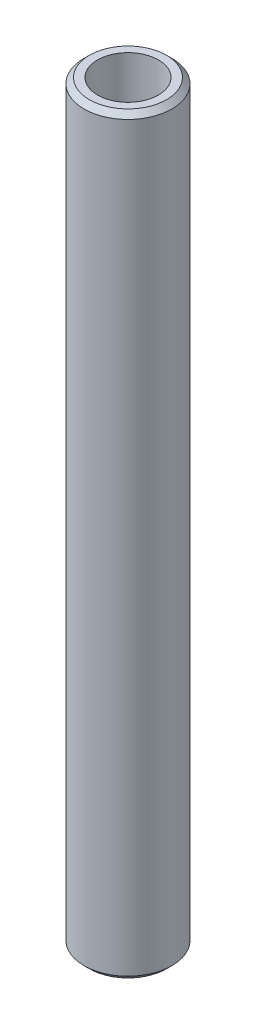
ISO-10303-21;
HEADER;
FILE_DESCRIPTION(('STEP AP214'),'2;1');
FILE_NAME('part.step','',(''),(''),'','','');
FILE_SCHEMA(('AUTOMOTIVE_DESIGN { 1 0 10303 214 1 1 1 1 }'));
ENDSEC;
DATA;
#1=APPLICATION_CONTEXT('core data for automotive mechanical design processes');
#2=APPLICATION_PROTOCOL_DEFINITION('international standard','automotive_design',2000,#1);
#3=PRODUCT_CONTEXT('',#1,'mechanical');
#4=PRODUCT('Part','Part','',(#3));
#5=PRODUCT_RELATED_PRODUCT_CATEGORY('part','',(#4));
#6=PRODUCT_DEFINITION_FORMATION('','',#4);
#7=PRODUCT_DEFINITION_CONTEXT('part definition',#1,'design');
#8=PRODUCT_DEFINITION('design','',#6,#7);
#9=PRODUCT_DEFINITION_SHAPE('','',#8);
#10=(LENGTH_UNIT() NAMED_UNIT(*) SI_UNIT(.MILLI.,.METRE.));
#11=(NAMED_UNIT(*) PLANE_ANGLE_UNIT() SI_UNIT($,.RADIAN.));
#12=(NAMED_UNIT(*) SI_UNIT($,.STERADIAN.) SOLID_ANGLE_UNIT());
#13=UNCERTAINTY_MEASURE_WITH_UNIT(LENGTH_MEASURE(1.E-05),#10,'distance_accuracy_value','');
#14=(GEOMETRIC_REPRESENTATION_CONTEXT(3) GLOBAL_UNCERTAINTY_ASSIGNED_CONTEXT((#13)) GLOBAL_UNIT_ASSIGNED_CONTEXT((#10,
#11,#12)) REPRESENTATION_CONTEXT('',''));
#15=CARTESIAN_POINT('',(0.,0.,0.));
#16=DIRECTION('',(0.,0.,1.));
#17=DIRECTION('',(1.,0.,0.));
#18=AXIS2_PLACEMENT_3D('',#15,#16,#17);
#19=CARTESIAN_POINT('',(0.,600.,0.));
#20=DIRECTION('',(0.,-1.,0.));
#21=DIRECTION('',(0.,0.,-1.));
#22=AXIS2_PLACEMENT_3D('',#19,#20,#21);
#23=CYLINDRICAL_SURFACE('',#22,35.);
#24=CARTESIAN_POINT('',(0.,595.724590498856,0.));
#25=DIRECTION('',(0.,1.,0.));
#26=DIRECTION('',(0.,0.,1.));
#27=AXIS2_PLACEMENT_3D('',#24,#25,#26);
#28=CIRCLE('',#27,35.);
#29=CARTESIAN_POINT('',(0.,595.724590498856,35.));
#30=VERTEX_POINT('',#29);
#31=EDGE_CURVE('E50',#30,#30,#28,.F.);
#32=ORIENTED_EDGE('',*,*,#31,.T.);
#33=EDGE_LOOP('',(#32));
#34=FACE_BOUND('',#33,.T.);
#35=CARTESIAN_POINT('',(0.,4.27540950114413,0.));
#36=DIRECTION('',(0.,1.,0.));
#37=DIRECTION('',(0.,0.,1.));
#38=AXIS2_PLACEMENT_3D('',#35,#36,#37);
#39=CIRCLE('',#38,35.);
#40=CARTESIAN_POINT('',(0.,4.27540950114413,35.));
#41=VERTEX_POINT('',#40);
#42=EDGE_CURVE('E51',#41,#41,#39,.T.);
#43=ORIENTED_EDGE('',*,*,#42,.T.);
#44=EDGE_LOOP('',(#43));
#45=FACE_BOUND('',#44,.T.);
#46=ADVANCED_FACE('F39',(#34,#45),#23,.T.);
#47=CARTESIAN_POINT('',(0.,600.,0.));
#48=DIRECTION('',(0.,1.,0.));
#49=DIRECTION('',(0.,0.,1.));
#50=AXIS2_PLACEMENT_3D('',#47,#48,#49);
#51=PLANE('',#50);
#52=CARTESIAN_POINT('',(0.,600.,0.));
#53=DIRECTION('',(0.,1.,0.));
#54=DIRECTION('',(0.,0.,1.));
#55=AXIS2_PLACEMENT_3D('',#52,#53,#54);
#56=CIRCLE('',#55,30.724590498856);
#57=CARTESIAN_POINT('',(0.,600.,30.724590498856));
#58=VERTEX_POINT('',#57);
#59=EDGE_CURVE('E54',#58,#58,#56,.T.);
#60=ORIENTED_EDGE('',*,*,#59,.T.);
#61=EDGE_LOOP('',(#60));
#62=FACE_BOUND('',#61,.T.);
#63=CARTESIAN_POINT('',(0.,600.,0.));
#64=DIRECTION('',(0.,1.,0.));
#65=DIRECTION('',(0.,0.,1.));
#66=AXIS2_PLACEMENT_3D('',#63,#64,#65);
#67=CIRCLE('',#66,24.2686248723088);
#68=CARTESIAN_POINT('',(0.,600.,24.2686248723088));
#69=VERTEX_POINT('',#68);
#70=EDGE_CURVE('E58',#69,#69,#67,.T.);
#71=ORIENTED_EDGE('',*,*,#70,.F.);
#72=EDGE_LOOP('',(#71));
#73=FACE_BOUND('',#72,.T.);
#74=ADVANCED_FACE('F69',(#62,#73),#51,.T.);
#75=CARTESIAN_POINT('',(0.,0.,0.));
#76=DIRECTION('',(0.,1.,0.));
#77=DIRECTION('',(0.,0.,1.));
#78=AXIS2_PLACEMENT_3D('',#75,#76,#77);
#79=PLANE('',#78);
#80=CARTESIAN_POINT('',(0.,0.,0.));
#81=DIRECTION('',(0.,1.,0.));
#82=DIRECTION('',(0.,0.,1.));
#83=AXIS2_PLACEMENT_3D('',#80,#81,#82);
#84=CIRCLE('',#83,30.7245904988558);
#85=CARTESIAN_POINT('',(0.,0.,30.7245904988558));
#86=VERTEX_POINT('',#85);
#87=EDGE_CURVE('E10',#86,#86,#84,.F.);
#88=ORIENTED_EDGE('',*,*,#87,.T.);
#89=EDGE_LOOP('',(#88));
#90=FACE_BOUND('',#89,.T.);
#91=CARTESIAN_POINT('',(0.,0.,0.));
#92=DIRECTION('',(0.,1.,0.));
#93=DIRECTION('',(0.,0.,1.));
#94=AXIS2_PLACEMENT_3D('',#91,#92,#93);
#95=CIRCLE('',#94,24.2686248723088);
#96=CARTESIAN_POINT('',(0.,0.,24.2686248723088));
#97=VERTEX_POINT('',#96);
#98=EDGE_CURVE('E63',#97,#97,#95,.T.);
#99=ORIENTED_EDGE('',*,*,#98,.T.);
#100=EDGE_LOOP('',(#99));
#101=FACE_BOUND('',#100,.T.);
#102=ADVANCED_FACE('F75',(#90,#101),#79,.F.);
#103=CARTESIAN_POINT('',(0.,600.,0.));
#104=DIRECTION('',(0.,-1.,0.));
#105=DIRECTION('',(0.,0.,-1.));
#106=AXIS2_PLACEMENT_3D('',#103,#104,#105);
#107=CYLINDRICAL_SURFACE('',#106,24.2686248723088);
#108=ORIENTED_EDGE('',*,*,#70,.T.);
#109=EDGE_LOOP('',(#108));
#110=FACE_BOUND('',#109,.T.);
#111=ORIENTED_EDGE('',*,*,#98,.F.);
#112=EDGE_LOOP('',(#111));
#113=FACE_BOUND('',#112,.T.);
#114=ADVANCED_FACE('F70',(#110,#113),#107,.F.);
#115=CARTESIAN_POINT('',(0.,600.,0.));
#116=DIRECTION('',(0.,-1.,0.));
#117=DIRECTION('',(0.,0.,-1.));
#118=AXIS2_PLACEMENT_3D('',#115,#116,#117);
#119=CONICAL_SURFACE('',#118,30.724590498856,0.785398163397439);
#120=ORIENTED_EDGE('',*,*,#31,.F.);
#121=EDGE_LOOP('',(#120));
#122=FACE_BOUND('',#121,.T.);
#123=ORIENTED_EDGE('',*,*,#59,.F.);
#124=EDGE_LOOP('',(#123));
#125=FACE_BOUND('',#124,.T.);
#126=ADVANCED_FACE('F81',(#122,#125),#119,.T.);
#127=CARTESIAN_POINT('',(0.,4.27540950114413,0.));
#128=DIRECTION('',(0.,1.,0.));
#129=DIRECTION('',(0.,0.,1.));
#130=AXIS2_PLACEMENT_3D('',#127,#128,#129);
#131=CONICAL_SURFACE('',#130,35.,0.785398163397452);
#132=ORIENTED_EDGE('',*,*,#87,.F.);
#133=EDGE_LOOP('',(#132));
#134=FACE_BOUND('',#133,.T.);
#135=ORIENTED_EDGE('',*,*,#42,.F.);
#136=EDGE_LOOP('',(#135));
#137=FACE_BOUND('',#136,.T.);
#138=ADVANCED_FACE('F45',(#134,#137),#131,.T.);
#139=CLOSED_SHELL('',(#46,#74,#102,#114,#126,#138));
#140=MANIFOLD_SOLID_BREP('B2',#139);
#141=ADVANCED_BREP_SHAPE_REPRESENTATION('',(#18,#140),#14);
#142=SHAPE_DEFINITION_REPRESENTATION(#9,#141);
ENDSEC;
END-ISO-10303-21;
